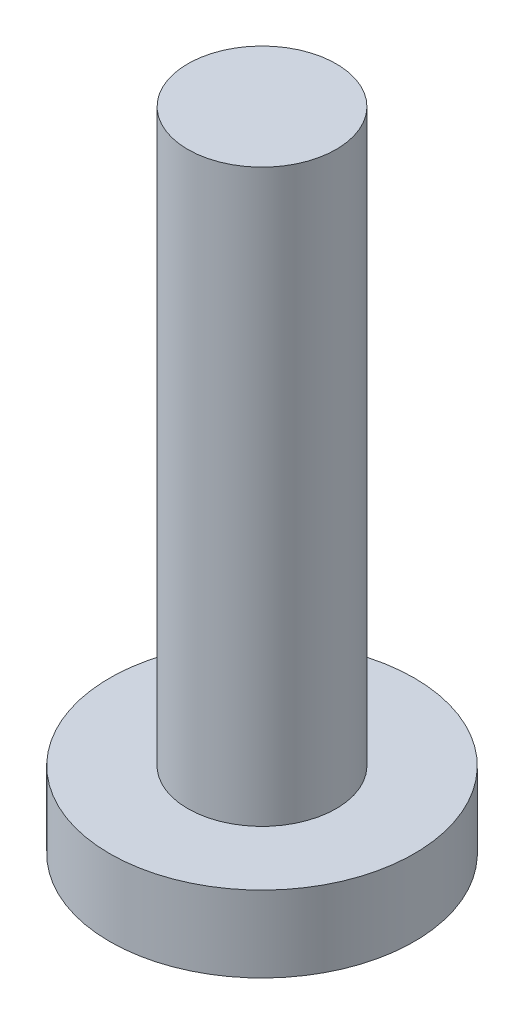
ISO-10303-21;
HEADER;
FILE_DESCRIPTION(('STEP AP214'),'2;1');
FILE_NAME('part.step','',(''),(''),'','','');
FILE_SCHEMA(('AUTOMOTIVE_DESIGN { 1 0 10303 214 1 1 1 1 }'));
ENDSEC;
DATA;
#1=APPLICATION_CONTEXT('core data for automotive mechanical design processes');
#2=APPLICATION_PROTOCOL_DEFINITION('international standard','automotive_design',2000,#1);
#3=PRODUCT_CONTEXT('',#1,'mechanical');
#4=PRODUCT('Part','Part','',(#3));
#5=PRODUCT_RELATED_PRODUCT_CATEGORY('part','',(#4));
#6=PRODUCT_DEFINITION_FORMATION('','',#4);
#7=PRODUCT_DEFINITION_CONTEXT('part definition',#1,'design');
#8=PRODUCT_DEFINITION('design','',#6,#7);
#9=PRODUCT_DEFINITION_SHAPE('','',#8);
#10=(LENGTH_UNIT() NAMED_UNIT(*) SI_UNIT(.MILLI.,.METRE.));
#11=(NAMED_UNIT(*) PLANE_ANGLE_UNIT() SI_UNIT($,.RADIAN.));
#12=(NAMED_UNIT(*) SI_UNIT($,.STERADIAN.) SOLID_ANGLE_UNIT());
#13=UNCERTAINTY_MEASURE_WITH_UNIT(LENGTH_MEASURE(1.E-05),#10,'distance_accuracy_value','');
#14=(GEOMETRIC_REPRESENTATION_CONTEXT(3) GLOBAL_UNCERTAINTY_ASSIGNED_CONTEXT((#13)) GLOBAL_UNIT_ASSIGNED_CONTEXT((#10,
#11,#12)) REPRESENTATION_CONTEXT('',''));
#15=CARTESIAN_POINT('',(0.,0.,0.));
#16=DIRECTION('',(0.,0.,1.));
#17=DIRECTION('',(1.,0.,0.));
#18=AXIS2_PLACEMENT_3D('',#15,#16,#17);
#19=CARTESIAN_POINT('',(0.,-2.,0.));
#20=DIRECTION('',(0.,1.,0.));
#21=DIRECTION('',(0.,0.,1.));
#22=AXIS2_PLACEMENT_3D('',#19,#20,#21);
#23=CYLINDRICAL_SURFACE('',#22,4.);
#24=CARTESIAN_POINT('',(0.,-2.,0.));
#25=DIRECTION('',(0.,1.,0.));
#26=DIRECTION('',(0.,0.,1.));
#27=AXIS2_PLACEMENT_3D('',#24,#25,#26);
#28=CIRCLE('',#27,4.);
#29=CARTESIAN_POINT('',(0.,-2.,4.));
#30=VERTEX_POINT('',#29);
#31=EDGE_CURVE('E45',#30,#30,#28,.T.);
#32=ORIENTED_EDGE('',*,*,#31,.T.);
#33=EDGE_LOOP('',(#32));
#34=FACE_BOUND('',#33,.T.);
#35=CARTESIAN_POINT('',(0.,0.,0.));
#36=DIRECTION('',(0.,1.,0.));
#37=DIRECTION('',(0.,0.,1.));
#38=AXIS2_PLACEMENT_3D('',#35,#36,#37);
#39=CIRCLE('',#38,4.);
#40=CARTESIAN_POINT('',(0.,0.,4.));
#41=VERTEX_POINT('',#40);
#42=EDGE_CURVE('E40',#41,#41,#39,.T.);
#43=ORIENTED_EDGE('',*,*,#42,.F.);
#44=EDGE_LOOP('',(#43));
#45=FACE_BOUND('',#44,.T.);
#46=ADVANCED_FACE('F37',(#34,#45),#23,.T.);
#47=CARTESIAN_POINT('',(0.,-2.,0.));
#48=DIRECTION('',(0.,1.,0.));
#49=DIRECTION('',(0.,0.,1.));
#50=AXIS2_PLACEMENT_3D('',#47,#48,#49);
#51=PLANE('',#50);
#52=ORIENTED_EDGE('',*,*,#31,.F.);
#53=EDGE_LOOP('',(#52));
#54=FACE_BOUND('',#53,.T.);
#55=ADVANCED_FACE('F64',(#54),#51,.F.);
#56=CARTESIAN_POINT('',(0.,0.,0.));
#57=DIRECTION('',(0.,1.,0.));
#58=DIRECTION('',(0.,0.,1.));
#59=AXIS2_PLACEMENT_3D('',#56,#57,#58);
#60=PLANE('',#59);
#61=CARTESIAN_POINT('',(0.,0.,0.));
#62=DIRECTION('',(0.,1.,0.));
#63=DIRECTION('',(0.,0.,1.));
#64=AXIS2_PLACEMENT_3D('',#61,#62,#63);
#65=CIRCLE('',#64,1.95);
#66=CARTESIAN_POINT('',(0.,0.,1.95));
#67=VERTEX_POINT('',#66);
#68=EDGE_CURVE('E10',#67,#67,#65,.T.);
#69=ORIENTED_EDGE('',*,*,#68,.F.);
#70=EDGE_LOOP('',(#69));
#71=FACE_BOUND('',#70,.T.);
#72=ORIENTED_EDGE('',*,*,#42,.T.);
#73=EDGE_LOOP('',(#72));
#74=FACE_BOUND('',#73,.T.);
#75=ADVANCED_FACE('F61',(#71,#74),#60,.T.);
#76=CARTESIAN_POINT('',(0.,15.,0.));
#77=DIRECTION('',(0.,-1.,0.));
#78=DIRECTION('',(0.,0.,-1.));
#79=AXIS2_PLACEMENT_3D('',#76,#77,#78);
#80=CYLINDRICAL_SURFACE('',#79,1.95);
#81=CARTESIAN_POINT('',(0.,15.,0.));
#82=DIRECTION('',(0.,1.,0.));
#83=DIRECTION('',(0.,0.,1.));
#84=AXIS2_PLACEMENT_3D('',#81,#82,#83);
#85=CIRCLE('',#84,1.95);
#86=CARTESIAN_POINT('',(0.,15.,1.95));
#87=VERTEX_POINT('',#86);
#88=EDGE_CURVE('E52',#87,#87,#85,.T.);
#89=ORIENTED_EDGE('',*,*,#88,.F.);
#90=EDGE_LOOP('',(#89));
#91=FACE_BOUND('',#90,.T.);
#92=ORIENTED_EDGE('',*,*,#68,.T.);
#93=EDGE_LOOP('',(#92));
#94=FACE_BOUND('',#93,.T.);
#95=ADVANCED_FACE('F75',(#91,#94),#80,.T.);
#96=CARTESIAN_POINT('',(0.,15.,0.));
#97=DIRECTION('',(0.,1.,0.));
#98=DIRECTION('',(0.,0.,1.));
#99=AXIS2_PLACEMENT_3D('',#96,#97,#98);
#100=PLANE('',#99);
#101=ORIENTED_EDGE('',*,*,#88,.T.);
#102=EDGE_LOOP('',(#101));
#103=FACE_BOUND('',#102,.T.);
#104=ADVANCED_FACE('F80',(#103),#100,.T.);
#105=CLOSED_SHELL('',(#46,#55,#75,#95,#104));
#106=MANIFOLD_SOLID_BREP('B2',#105);
#107=ADVANCED_BREP_SHAPE_REPRESENTATION('',(#18,#106),#14);
#108=SHAPE_DEFINITION_REPRESENTATION(#9,#107);
ENDSEC;
END-ISO-10303-21;
